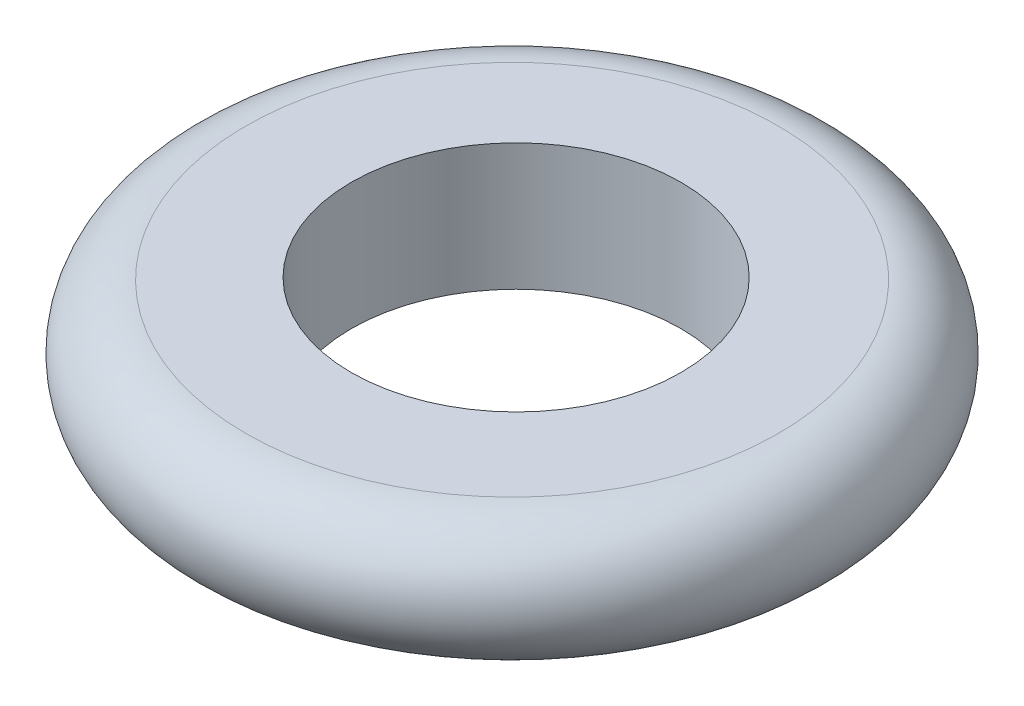
ISO-10303-21;
HEADER;
FILE_DESCRIPTION(('STEP AP214'),'2;1');
FILE_NAME('part.step','',(''),(''),'','','');
FILE_SCHEMA(('AUTOMOTIVE_DESIGN { 1 0 10303 214 1 1 1 1 }'));
ENDSEC;
DATA;
#1=APPLICATION_CONTEXT('core data for automotive mechanical design processes');
#2=APPLICATION_PROTOCOL_DEFINITION('international standard','automotive_design',2000,#1);
#3=PRODUCT_CONTEXT('',#1,'mechanical');
#4=PRODUCT('Part','Part','',(#3));
#5=PRODUCT_RELATED_PRODUCT_CATEGORY('part','',(#4));
#6=PRODUCT_DEFINITION_FORMATION('','',#4);
#7=PRODUCT_DEFINITION_CONTEXT('part definition',#1,'design');
#8=PRODUCT_DEFINITION('design','',#6,#7);
#9=PRODUCT_DEFINITION_SHAPE('','',#8);
#10=(LENGTH_UNIT() NAMED_UNIT(*) SI_UNIT(.MILLI.,.METRE.));
#11=(NAMED_UNIT(*) PLANE_ANGLE_UNIT() SI_UNIT($,.RADIAN.));
#12=(NAMED_UNIT(*) SI_UNIT($,.STERADIAN.) SOLID_ANGLE_UNIT());
#13=UNCERTAINTY_MEASURE_WITH_UNIT(LENGTH_MEASURE(1.E-05),#10,'distance_accuracy_value','');
#14=(GEOMETRIC_REPRESENTATION_CONTEXT(3) GLOBAL_UNCERTAINTY_ASSIGNED_CONTEXT((#13)) GLOBAL_UNIT_ASSIGNED_CONTEXT((#10,
#11,#12)) REPRESENTATION_CONTEXT('',''));
#15=CARTESIAN_POINT('',(0.,0.,0.));
#16=DIRECTION('',(0.,0.,1.));
#17=DIRECTION('',(1.,0.,0.));
#18=AXIS2_PLACEMENT_3D('',#15,#16,#17);
#19=CARTESIAN_POINT('',(0.,2.5,0.));
#20=DIRECTION('',(0.,1.,0.));
#21=DIRECTION('',(0.,0.,1.));
#22=AXIS2_PLACEMENT_3D('',#19,#20,#21);
#23=TOROIDAL_SURFACE('',#22,10.5,2.5);
#24=CARTESIAN_POINT('',(0.,5.,0.));
#25=DIRECTION('',(0.,1.,0.));
#26=DIRECTION('',(0.,0.,1.));
#27=AXIS2_PLACEMENT_3D('',#24,#25,#26);
#28=CIRCLE('',#27,10.5);
#29=CARTESIAN_POINT('',(0.,5.,10.5));
#30=VERTEX_POINT('',#29);
#31=EDGE_CURVE('E47',#30,#30,#28,.T.);
#32=ORIENTED_EDGE('',*,*,#31,.F.);
#33=EDGE_LOOP('',(#32));
#34=FACE_BOUND('',#33,.T.);
#35=CARTESIAN_POINT('',(0.,0.,0.));
#36=DIRECTION('',(0.,1.,0.));
#37=DIRECTION('',(0.,0.,1.));
#38=AXIS2_PLACEMENT_3D('',#35,#36,#37);
#39=CIRCLE('',#38,10.5);
#40=CARTESIAN_POINT('',(0.,0.,10.5));
#41=VERTEX_POINT('',#40);
#42=EDGE_CURVE('E10',#41,#41,#39,.F.);
#43=ORIENTED_EDGE('',*,*,#42,.F.);
#44=EDGE_LOOP('',(#43));
#45=FACE_BOUND('',#44,.T.);
#46=ADVANCED_FACE('F39',(#34,#45),#23,.T.);
#47=CARTESIAN_POINT('',(0.,5.,0.));
#48=DIRECTION('',(0.,1.,0.));
#49=DIRECTION('',(0.,0.,1.));
#50=AXIS2_PLACEMENT_3D('',#47,#48,#49);
#51=PLANE('',#50);
#52=ORIENTED_EDGE('',*,*,#31,.T.);
#53=EDGE_LOOP('',(#52));
#54=FACE_BOUND('',#53,.T.);
#55=CARTESIAN_POINT('',(0.,5.,-0.159304864094963));
#56=DIRECTION('',(0.,1.,0.));
#57=DIRECTION('',(0.,0.,1.));
#58=AXIS2_PLACEMENT_3D('',#55,#56,#57);
#59=CIRCLE('',#58,6.5);
#60=CARTESIAN_POINT('',(0.,5.,6.34069513590504));
#61=VERTEX_POINT('',#60);
#62=EDGE_CURVE('E52',#61,#61,#59,.T.);
#63=ORIENTED_EDGE('',*,*,#62,.F.);
#64=EDGE_LOOP('',(#63));
#65=FACE_BOUND('',#64,.T.);
#66=ADVANCED_FACE('F73',(#54,#65),#51,.T.);
#67=CARTESIAN_POINT('',(0.,0.,0.));
#68=DIRECTION('',(0.,1.,0.));
#69=DIRECTION('',(0.,0.,1.));
#70=AXIS2_PLACEMENT_3D('',#67,#68,#69);
#71=PLANE('',#70);
#72=ORIENTED_EDGE('',*,*,#42,.T.);
#73=EDGE_LOOP('',(#72));
#74=FACE_BOUND('',#73,.T.);
#75=CARTESIAN_POINT('',(0.,0.,-0.159304864094963));
#76=DIRECTION('',(0.,1.,0.));
#77=DIRECTION('',(0.,0.,1.));
#78=AXIS2_PLACEMENT_3D('',#75,#76,#77);
#79=CIRCLE('',#78,6.5);
#80=CARTESIAN_POINT('',(0.,0.,6.34069513590504));
#81=VERTEX_POINT('',#80);
#82=EDGE_CURVE('E57',#81,#81,#79,.T.);
#83=ORIENTED_EDGE('',*,*,#82,.T.);
#84=EDGE_LOOP('',(#83));
#85=FACE_BOUND('',#84,.T.);
#86=ADVANCED_FACE('F64',(#74,#85),#71,.F.);
#87=CARTESIAN_POINT('',(0.,5.,-0.159304864094963));
#88=DIRECTION('',(0.,-1.,0.));
#89=DIRECTION('',(0.,0.,-1.));
#90=AXIS2_PLACEMENT_3D('',#87,#88,#89);
#91=CYLINDRICAL_SURFACE('',#90,6.5);
#92=ORIENTED_EDGE('',*,*,#62,.T.);
#93=EDGE_LOOP('',(#92));
#94=FACE_BOUND('',#93,.T.);
#95=ORIENTED_EDGE('',*,*,#82,.F.);
#96=EDGE_LOOP('',(#95));
#97=FACE_BOUND('',#96,.T.);
#98=ADVANCED_FACE('F66',(#94,#97),#91,.F.);
#99=CLOSED_SHELL('',(#46,#66,#86,#98));
#100=MANIFOLD_SOLID_BREP('B2',#99);
#101=ADVANCED_BREP_SHAPE_REPRESENTATION('',(#18,#100),#14);
#102=SHAPE_DEFINITION_REPRESENTATION(#9,#101);
ENDSEC;
END-ISO-10303-21;
